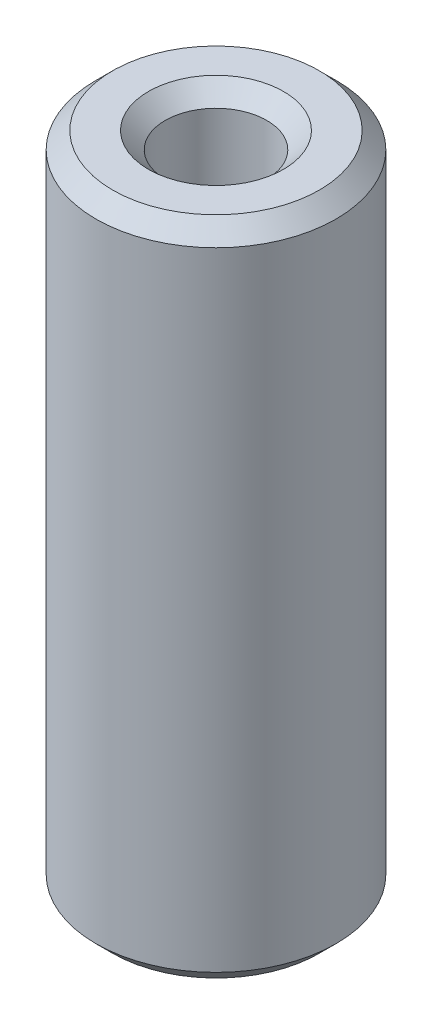
ISO-10303-21;
HEADER;
FILE_DESCRIPTION(('STEP AP214'),'2;1');
FILE_NAME('part.step','',(''),(''),'','','');
FILE_SCHEMA(('AUTOMOTIVE_DESIGN { 1 0 10303 214 1 1 1 1 }'));
ENDSEC;
DATA;
#1=APPLICATION_CONTEXT('core data for automotive mechanical design processes');
#2=APPLICATION_PROTOCOL_DEFINITION('international standard','automotive_design',2000,#1);
#3=PRODUCT_CONTEXT('',#1,'mechanical');
#4=PRODUCT('Part','Part','',(#3));
#5=PRODUCT_RELATED_PRODUCT_CATEGORY('part','',(#4));
#6=PRODUCT_DEFINITION_FORMATION('','',#4);
#7=PRODUCT_DEFINITION_CONTEXT('part definition',#1,'design');
#8=PRODUCT_DEFINITION('design','',#6,#7);
#9=PRODUCT_DEFINITION_SHAPE('','',#8);
#10=(LENGTH_UNIT() NAMED_UNIT(*) SI_UNIT(.MILLI.,.METRE.));
#11=(NAMED_UNIT(*) PLANE_ANGLE_UNIT() SI_UNIT($,.RADIAN.));
#12=(NAMED_UNIT(*) SI_UNIT($,.STERADIAN.) SOLID_ANGLE_UNIT());
#13=UNCERTAINTY_MEASURE_WITH_UNIT(LENGTH_MEASURE(1.E-05),#10,'distance_accuracy_value','');
#14=(GEOMETRIC_REPRESENTATION_CONTEXT(3) GLOBAL_UNCERTAINTY_ASSIGNED_CONTEXT((#13)) GLOBAL_UNIT_ASSIGNED_CONTEXT((#10,
#11,#12)) REPRESENTATION_CONTEXT('',''));
#15=CARTESIAN_POINT('',(0.,0.,0.));
#16=DIRECTION('',(0.,0.,1.));
#17=DIRECTION('',(1.,0.,0.));
#18=AXIS2_PLACEMENT_3D('',#15,#16,#17);
#19=CARTESIAN_POINT('',(0.,151.34924927896,0.));
#20=DIRECTION('',(0.,-1.,0.));
#21=DIRECTION('',(0.,0.,-1.));
#22=AXIS2_PLACEMENT_3D('',#19,#20,#21);
#23=CYLINDRICAL_SURFACE('',#22,27.5);
#24=CARTESIAN_POINT('',(0.,3.8307177825152,0.));
#25=DIRECTION('',(0.,1.,0.));
#26=DIRECTION('',(0.,0.,1.));
#27=AXIS2_PLACEMENT_3D('',#24,#25,#26);
#28=CIRCLE('',#27,27.5);
#29=CARTESIAN_POINT('',(0.,3.8307177825152,27.5));
#30=VERTEX_POINT('',#29);
#31=EDGE_CURVE('E10',#30,#30,#28,.T.);
#32=ORIENTED_EDGE('',*,*,#31,.T.);
#33=EDGE_LOOP('',(#32));
#34=FACE_BOUND('',#33,.T.);
#35=CARTESIAN_POINT('',(0.,147.518531496444,0.));
#36=DIRECTION('',(0.,1.,0.));
#37=DIRECTION('',(0.,0.,1.));
#38=AXIS2_PLACEMENT_3D('',#35,#36,#37);
#39=CIRCLE('',#38,27.5);
#40=CARTESIAN_POINT('',(0.,147.518531496444,27.5));
#41=VERTEX_POINT('',#40);
#42=EDGE_CURVE('E50',#41,#41,#39,.F.);
#43=ORIENTED_EDGE('',*,*,#42,.T.);
#44=EDGE_LOOP('',(#43));
#45=FACE_BOUND('',#44,.T.);
#46=ADVANCED_FACE('F39',(#34,#45),#23,.T.);
#47=CARTESIAN_POINT('',(0.,151.34924927896,0.));
#48=DIRECTION('',(0.,1.,0.));
#49=DIRECTION('',(0.,0.,1.));
#50=AXIS2_PLACEMENT_3D('',#47,#48,#49);
#51=PLANE('',#50);
#52=CARTESIAN_POINT('',(0.,151.34924927896,0.));
#53=DIRECTION('',(0.,1.,0.));
#54=DIRECTION('',(0.,0.,1.));
#55=AXIS2_PLACEMENT_3D('',#52,#53,#54);
#56=CIRCLE('',#55,15.4620450279943);
#57=CARTESIAN_POINT('',(0.,151.34924927896,15.4620450279943));
#58=VERTEX_POINT('',#57);
#59=EDGE_CURVE('E58',#58,#58,#56,.F.);
#60=ORIENTED_EDGE('',*,*,#59,.T.);
#61=EDGE_LOOP('',(#60));
#62=FACE_BOUND('',#61,.T.);
#63=CARTESIAN_POINT('',(0.,151.34924927896,0.));
#64=DIRECTION('',(0.,1.,0.));
#65=DIRECTION('',(0.,0.,1.));
#66=AXIS2_PLACEMENT_3D('',#63,#64,#65);
#67=CIRCLE('',#66,23.6692822174848);
#68=CARTESIAN_POINT('',(0.,151.34924927896,23.6692822174848));
#69=VERTEX_POINT('',#68);
#70=EDGE_CURVE('E61',#69,#69,#67,.T.);
#71=ORIENTED_EDGE('',*,*,#70,.T.);
#72=EDGE_LOOP('',(#71));
#73=FACE_BOUND('',#72,.T.);
#74=ADVANCED_FACE('F88',(#62,#73),#51,.T.);
#75=CARTESIAN_POINT('',(0.,0.,0.));
#76=DIRECTION('',(0.,1.,0.));
#77=DIRECTION('',(0.,0.,1.));
#78=AXIS2_PLACEMENT_3D('',#75,#76,#77);
#79=PLANE('',#78);
#80=CARTESIAN_POINT('',(0.,0.,0.));
#81=DIRECTION('',(0.,1.,0.));
#82=DIRECTION('',(0.,0.,1.));
#83=AXIS2_PLACEMENT_3D('',#80,#81,#82);
#84=CIRCLE('',#83,15.4620450279942);
#85=CARTESIAN_POINT('',(0.,0.,15.4620450279942));
#86=VERTEX_POINT('',#85);
#87=EDGE_CURVE('E51',#86,#86,#84,.T.);
#88=ORIENTED_EDGE('',*,*,#87,.T.);
#89=EDGE_LOOP('',(#88));
#90=FACE_BOUND('',#89,.T.);
#91=CARTESIAN_POINT('',(0.,0.,0.));
#92=DIRECTION('',(0.,1.,0.));
#93=DIRECTION('',(0.,0.,1.));
#94=AXIS2_PLACEMENT_3D('',#91,#92,#93);
#95=CIRCLE('',#94,23.6692822174848);
#96=CARTESIAN_POINT('',(0.,0.,23.6692822174848));
#97=VERTEX_POINT('',#96);
#98=EDGE_CURVE('E54',#97,#97,#95,.F.);
#99=ORIENTED_EDGE('',*,*,#98,.T.);
#100=EDGE_LOOP('',(#99));
#101=FACE_BOUND('',#100,.T.);
#102=ADVANCED_FACE('F83',(#90,#101),#79,.F.);
#103=CARTESIAN_POINT('',(0.,151.34924927896,0.));
#104=DIRECTION('',(0.,-1.,0.));
#105=DIRECTION('',(0.,0.,-1.));
#106=AXIS2_PLACEMENT_3D('',#103,#104,#105);
#107=CYLINDRICAL_SURFACE('',#106,11.631327245479);
#108=CARTESIAN_POINT('',(0.,147.518531496444,0.));
#109=DIRECTION('',(0.,1.,0.));
#110=DIRECTION('',(0.,0.,1.));
#111=AXIS2_PLACEMENT_3D('',#108,#109,#110);
#112=CIRCLE('',#111,11.631327245479);
#113=CARTESIAN_POINT('',(0.,147.518531496444,11.631327245479));
#114=VERTEX_POINT('',#113);
#115=EDGE_CURVE('E67',#114,#114,#112,.T.);
#116=ORIENTED_EDGE('',*,*,#115,.T.);
#117=EDGE_LOOP('',(#116));
#118=FACE_BOUND('',#117,.T.);
#119=CARTESIAN_POINT('',(0.,3.83071778251523,0.));
#120=DIRECTION('',(0.,1.,0.));
#121=DIRECTION('',(0.,0.,1.));
#122=AXIS2_PLACEMENT_3D('',#119,#120,#121);
#123=CIRCLE('',#122,11.631327245479);
#124=CARTESIAN_POINT('',(0.,3.83071778251523,11.631327245479));
#125=VERTEX_POINT('',#124);
#126=EDGE_CURVE('E69',#125,#125,#123,.F.);
#127=ORIENTED_EDGE('',*,*,#126,.T.);
#128=EDGE_LOOP('',(#127));
#129=FACE_BOUND('',#128,.T.);
#130=ADVANCED_FACE('F71',(#118,#129),#107,.F.);
#131=CARTESIAN_POINT('',(0.,147.518531496444,0.));
#132=DIRECTION('',(0.,1.,0.));
#133=DIRECTION('',(0.,0.,1.));
#134=AXIS2_PLACEMENT_3D('',#131,#132,#133);
#135=CONICAL_SURFACE('',#134,11.631327245479,0.78539816339745);
#136=ORIENTED_EDGE('',*,*,#59,.F.);
#137=EDGE_LOOP('',(#136));
#138=FACE_BOUND('',#137,.T.);
#139=ORIENTED_EDGE('',*,*,#115,.F.);
#140=EDGE_LOOP('',(#139));
#141=FACE_BOUND('',#140,.T.);
#142=ADVANCED_FACE('F77',(#138,#141),#135,.F.);
#143=CARTESIAN_POINT('',(0.,0.,0.));
#144=DIRECTION('',(0.,-1.,0.));
#145=DIRECTION('',(0.,0.,-1.));
#146=AXIS2_PLACEMENT_3D('',#143,#144,#145);
#147=CONICAL_SURFACE('',#146,15.4620450279942,0.785398163397446);
#148=ORIENTED_EDGE('',*,*,#126,.F.);
#149=EDGE_LOOP('',(#148));
#150=FACE_BOUND('',#149,.T.);
#151=ORIENTED_EDGE('',*,*,#87,.F.);
#152=EDGE_LOOP('',(#151));
#153=FACE_BOUND('',#152,.T.);
#154=ADVANCED_FACE('F73',(#150,#153),#147,.F.);
#155=CARTESIAN_POINT('',(0.,3.8307177825152,0.));
#156=DIRECTION('',(0.,1.,0.));
#157=DIRECTION('',(0.,0.,1.));
#158=AXIS2_PLACEMENT_3D('',#155,#156,#157);
#159=CONICAL_SURFACE('',#158,27.5,0.785398163397452);
#160=CARTESIAN_POINT('',(0.,0.,23.6692822174848));
#161=CARTESIAN_POINT('',(0.,0.039903310234533,23.7091855277193));
#162=CARTESIAN_POINT('',(0.,0.0798066204690663,23.7490888379538));
#163=CARTESIAN_POINT('',(0.,0.159613240938133,23.8288954584229));
#164=CARTESIAN_POINT('',(0.,0.199516551172666,23.8687987686574));
#165=CARTESIAN_POINT('',(0.,0.279323171641733,23.9486053891265));
#166=CARTESIAN_POINT('',(0.,0.319226481876267,23.988508699361));
#167=CARTESIAN_POINT('',(0.,0.399033102345333,24.0683153198301));
#168=CARTESIAN_POINT('',(0.,0.438936412579866,24.1082186300646));
#169=CARTESIAN_POINT('',(0.,0.518743033048933,24.1880252505337));
#170=CARTESIAN_POINT('',(0.,0.558646343283466,24.2279285607682));
#171=CARTESIAN_POINT('',(0.,0.638452963752534,24.3077351812373));
#172=CARTESIAN_POINT('',(0.,0.678356273987067,24.3476384914718));
#173=CARTESIAN_POINT('',(0.,0.758162894456134,24.4274451119409));
#174=CARTESIAN_POINT('',(0.,0.798066204690667,24.4673484221754));
#175=CARTESIAN_POINT('',(0.,0.877872825159733,24.5471550426445));
#176=CARTESIAN_POINT('',(0.,0.917776135394267,24.587058352879));
#177=CARTESIAN_POINT('',(0.,0.997582755863334,24.6668649733481));
#178=CARTESIAN_POINT('',(0.,1.03748606609787,24.7067682835826));
#179=CARTESIAN_POINT('',(0.,1.11729268656693,24.7865749040517));
#180=CARTESIAN_POINT('',(0.,1.15719599680147,24.8264782142862));
#181=CARTESIAN_POINT('',(0.,1.23700261727053,24.9062848347553));
#182=CARTESIAN_POINT('',(0.,1.27690592750507,24.9461881449898));
#183=CARTESIAN_POINT('',(0.,1.35671254797413,25.0259947654589));
#184=CARTESIAN_POINT('',(0.,1.39661585820867,25.0658980756934));
#185=CARTESIAN_POINT('',(0.,1.47642247867773,25.1457046961625));
#186=CARTESIAN_POINT('',(0.,1.51632578891227,25.185608006397));
#187=CARTESIAN_POINT('',(0.,1.59613240938133,25.2654146268661));
#188=CARTESIAN_POINT('',(0.,1.63603571961587,25.3053179371006));
#189=CARTESIAN_POINT('',(0.,1.71584234008493,25.3851245575697));
#190=CARTESIAN_POINT('',(0.,1.75574565031947,25.4250278678042));
#191=CARTESIAN_POINT('',(0.,1.83555227078853,25.5048344882733));
#192=CARTESIAN_POINT('',(0.,1.87545558102307,25.5447377985078));
#193=CARTESIAN_POINT('',(0.,1.95526220149213,25.6245444189769));
#194=CARTESIAN_POINT('',(0.,1.99516551172667,25.6644477292115));
#195=CARTESIAN_POINT('',(0.,2.07497213219573,25.7442543496805));
#196=CARTESIAN_POINT('',(0.,2.11487544243027,25.7841576599151));
#197=CARTESIAN_POINT('',(0.,2.19468206289933,25.8639642803841));
#198=CARTESIAN_POINT('',(0.,2.23458537313387,25.9038675906187));
#199=CARTESIAN_POINT('',(0.,2.31439199360294,25.9836742110877));
#200=CARTESIAN_POINT('',(0.,2.35429530383747,26.0235775213223));
#201=CARTESIAN_POINT('',(0.,2.43410192430653,26.1033841417913));
#202=CARTESIAN_POINT('',(0.,2.47400523454107,26.1432874520259));
#203=CARTESIAN_POINT('',(0.,2.55381185501014,26.2230940724949));
#204=CARTESIAN_POINT('',(0.,2.59371516524467,26.2629973827295));
#205=CARTESIAN_POINT('',(0.,2.67352178571374,26.3428040031985));
#206=CARTESIAN_POINT('',(0.,2.71342509594827,26.3827073134331));
#207=CARTESIAN_POINT('',(0.,2.79323171641734,26.4625139339021));
#208=CARTESIAN_POINT('',(0.,2.83313502665187,26.5024172441367));
#209=CARTESIAN_POINT('',(0.,2.91294164712094,26.5822238646057));
#210=CARTESIAN_POINT('',(0.,2.95284495735547,26.6221271748403));
#211=CARTESIAN_POINT('',(0.,3.03265157782454,26.7019337953093));
#212=CARTESIAN_POINT('',(0.,3.07255488805907,26.7418371055439));
#213=CARTESIAN_POINT('',(0.,3.15236150852814,26.8216437260129));
#214=CARTESIAN_POINT('',(0.,3.19226481876267,26.8615470362475));
#215=CARTESIAN_POINT('',(0.,3.27207143923174,26.9413536567165));
#216=CARTESIAN_POINT('',(0.,3.31197474946627,26.9812569669511));
#217=CARTESIAN_POINT('',(0.,3.39178136993534,27.0610635874201));
#218=CARTESIAN_POINT('',(0.,3.43168468016987,27.1009668976547));
#219=CARTESIAN_POINT('',(0.,3.51149130063894,27.1807735181237));
#220=CARTESIAN_POINT('',(0.,3.55139461087347,27.2206768283583));
#221=CARTESIAN_POINT('',(0.,3.63120123134254,27.3004834488273));
#222=CARTESIAN_POINT('',(0.,3.67110454157707,27.3403867590619));
#223=CARTESIAN_POINT('',(0.,3.75091116204614,27.4201933795309));
#224=CARTESIAN_POINT('',(0.,3.79081447228067,27.4600966897655));
#225=CARTESIAN_POINT('',(0.,3.8307177825152,27.5));
#226=B_SPLINE_CURVE_WITH_KNOTS('',3,(#160,#161,#162,#163,#164,#165,#166,#167,#168,#169,#170,
#171,#172,#173,#174,#175,#176,#177,#178,#179,#180,#181,#182,#183,#184,#185,#186,#187,#188,#189,
#190,#191,#192,#193,#194,#195,#196,#197,#198,#199,#200,#201,#202,#203,#204,#205,#206,#207,#208,
#209,#210,#211,#212,#213,#214,#215,#216,#217,#218,#219,#220,#221,#222,#223,#224,#225),
.UNSPECIFIED.,.F.,.F.,(4,2,2,2,2,2,2,2,2,2,2,2,2,2,2,2,2,2,2,2,2,2,2,2,2,2,2,2,2,2,2,2,4),(0.,
0.169295407551775,0.338590815103549,0.507886222655324,0.677181630207101,0.846477037758876,
1.01577244531065,1.18506785286243,1.3543632604142,1.52365866796598,1.69295407551775,
1.86224948306953,2.0315448906213,2.20084029817308,2.37013570572485,2.53943111327663,
2.7087265208284,2.87802192838018,3.04731733593196,3.21661274348373,3.38590815103551,
3.55520355858728,3.72449896613906,3.89379437369083,4.06308978124261,4.23238518879438,
4.40168059634616,4.57097600389794,4.74027141144971,4.90956681900148,5.07886222655326,
5.24815763410504,5.41745304165681),.UNSPECIFIED.);
#227=EDGE_CURVE('BSEAM76',#97,#30,#226,.T.);
#228=ORIENTED_EDGE('',*,*,#98,.F.);
#229=ORIENTED_EDGE('',*,*,#31,.F.);
#230=ORIENTED_EDGE('',*,*,#227,.T.);
#231=ORIENTED_EDGE('',*,*,#227,.F.);
#232=EDGE_LOOP('',(#228,#230,#229,#231));
#233=FACE_BOUND('',#232,.T.);
#234=ADVANCED_FACE('F76',(#233),#159,.T.);
#235=CARTESIAN_POINT('',(0.,151.34924927896,0.));
#236=DIRECTION('',(0.,-1.,0.));
#237=DIRECTION('',(0.,0.,-1.));
#238=AXIS2_PLACEMENT_3D('',#235,#236,#237);
#239=CONICAL_SURFACE('',#238,23.6692822174848,0.785398163397443);
#240=ORIENTED_EDGE('',*,*,#42,.F.);
#241=EDGE_LOOP('',(#240));
#242=FACE_BOUND('',#241,.T.);
#243=ORIENTED_EDGE('',*,*,#70,.F.);
#244=EDGE_LOOP('',(#243));
#245=FACE_BOUND('',#244,.T.);
#246=ADVANCED_FACE('F45',(#242,#245),#239,.T.);
#247=CLOSED_SHELL('',(#46,#74,#102,#130,#142,#154,#234,#246));
#248=MANIFOLD_SOLID_BREP('B2',#247);
#249=ADVANCED_BREP_SHAPE_REPRESENTATION('',(#18,#248),#14);
#250=SHAPE_DEFINITION_REPRESENTATION(#9,#249);
ENDSEC;
END-ISO-10303-21;
